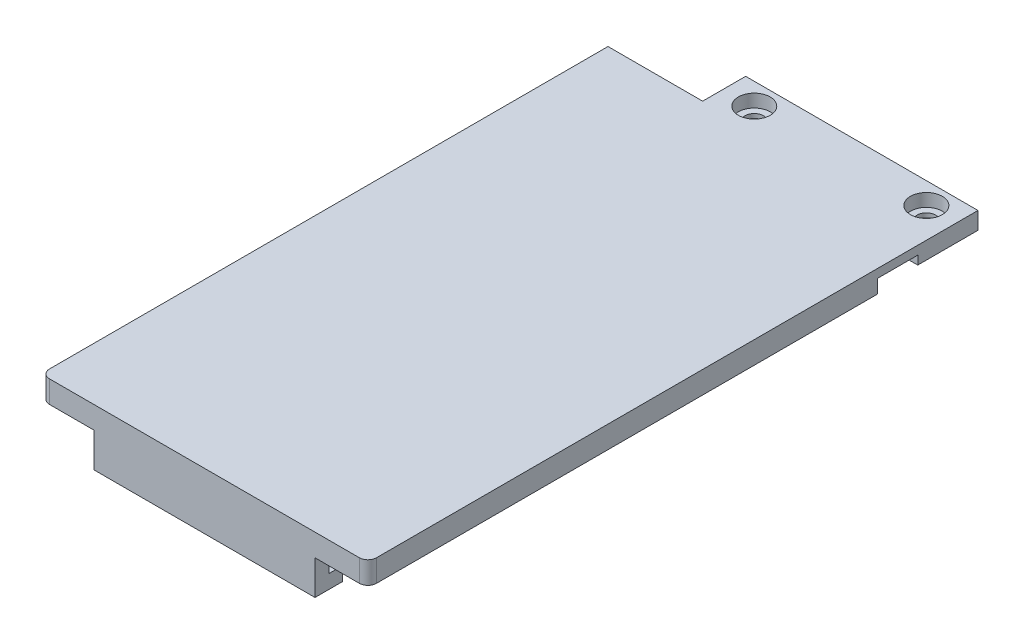
ISO-10303-21;
HEADER;
FILE_DESCRIPTION(('STEP AP214'),'2;1');
FILE_NAME('part.step','',(''),(''),'','','');
FILE_SCHEMA(('AUTOMOTIVE_DESIGN { 1 0 10303 214 1 1 1 1 }'));
ENDSEC;
DATA;
#1=APPLICATION_CONTEXT('core data for automotive mechanical design processes');
#2=APPLICATION_PROTOCOL_DEFINITION('international standard','automotive_design',2000,#1);
#3=PRODUCT_CONTEXT('',#1,'mechanical');
#4=PRODUCT('Part','Part','',(#3));
#5=PRODUCT_RELATED_PRODUCT_CATEGORY('part','',(#4));
#6=PRODUCT_DEFINITION_FORMATION('','',#4);
#7=PRODUCT_DEFINITION_CONTEXT('part definition',#1,'design');
#8=PRODUCT_DEFINITION('design','',#6,#7);
#9=PRODUCT_DEFINITION_SHAPE('','',#8);
#10=(LENGTH_UNIT() NAMED_UNIT(*) SI_UNIT(.MILLI.,.METRE.));
#11=(NAMED_UNIT(*) PLANE_ANGLE_UNIT() SI_UNIT($,.RADIAN.));
#12=(NAMED_UNIT(*) SI_UNIT($,.STERADIAN.) SOLID_ANGLE_UNIT());
#13=UNCERTAINTY_MEASURE_WITH_UNIT(LENGTH_MEASURE(1.E-05),#10,'distance_accuracy_value','');
#14=(GEOMETRIC_REPRESENTATION_CONTEXT(3) GLOBAL_UNCERTAINTY_ASSIGNED_CONTEXT((#13)) GLOBAL_UNIT_ASSIGNED_CONTEXT((#10,
#11,#12)) REPRESENTATION_CONTEXT('',''));
#15=CARTESIAN_POINT('',(0.,0.,0.));
#16=DIRECTION('',(0.,0.,1.));
#17=DIRECTION('',(1.,0.,0.));
#18=AXIS2_PLACEMENT_3D('',#15,#16,#17);
#19=CARTESIAN_POINT('',(15.5,-5.58,-35.45));
#20=DIRECTION('',(0.,1.,0.));
#21=DIRECTION('',(0.,0.,1.));
#22=AXIS2_PLACEMENT_3D('',#19,#20,#21);
#23=CYLINDRICAL_SURFACE('',#22,1.075);
#24=CARTESIAN_POINT('',(15.5,-1.,-35.45));
#25=DIRECTION('',(0.,1.,0.));
#26=DIRECTION('',(0.,0.,1.));
#27=AXIS2_PLACEMENT_3D('',#24,#25,#26);
#28=CIRCLE('',#27,1.075);
#29=CARTESIAN_POINT('',(15.5,-1.,-34.375));
#30=VERTEX_POINT('',#29);
#31=EDGE_CURVE('E259',#30,#30,#28,.T.);
#32=ORIENTED_EDGE('',*,*,#31,.F.);
#33=EDGE_LOOP('',(#32));
#34=FACE_BOUND('',#33,.T.);
#35=CARTESIAN_POINT('',(15.5,-0.5,-35.45));
#36=DIRECTION('',(0.,1.,0.));
#37=DIRECTION('',(0.,0.,1.));
#38=AXIS2_PLACEMENT_3D('',#35,#36,#37);
#39=CIRCLE('',#38,1.075);
#40=CARTESIAN_POINT('',(15.5,-0.5,-34.375));
#41=VERTEX_POINT('',#40);
#42=EDGE_CURVE('E39',#41,#41,#39,.F.);
#43=ORIENTED_EDGE('',*,*,#42,.F.);
#44=EDGE_LOOP('',(#43));
#45=FACE_BOUND('',#44,.T.);
#46=ADVANCED_FACE('F35',(#34,#45),#23,.F.);
#47=CARTESIAN_POINT('',(-4.5,-5.58,-35.45));
#48=DIRECTION('',(0.,1.,0.));
#49=DIRECTION('',(0.,0.,1.));
#50=AXIS2_PLACEMENT_3D('',#47,#48,#49);
#51=CYLINDRICAL_SURFACE('',#50,1.075);
#52=CARTESIAN_POINT('',(-4.5,-1.,-35.45));
#53=DIRECTION('',(0.,1.,0.));
#54=DIRECTION('',(0.,0.,1.));
#55=AXIS2_PLACEMENT_3D('',#52,#53,#54);
#56=CIRCLE('',#55,1.075);
#57=CARTESIAN_POINT('',(-4.5,-1.,-34.375));
#58=VERTEX_POINT('',#57);
#59=EDGE_CURVE('E262',#58,#58,#56,.T.);
#60=ORIENTED_EDGE('',*,*,#59,.F.);
#61=EDGE_LOOP('',(#60));
#62=FACE_BOUND('',#61,.T.);
#63=CARTESIAN_POINT('',(-4.5,-0.5,-35.45));
#64=DIRECTION('',(0.,1.,0.));
#65=DIRECTION('',(0.,0.,1.));
#66=AXIS2_PLACEMENT_3D('',#63,#64,#65);
#67=CIRCLE('',#66,1.075);
#68=CARTESIAN_POINT('',(-4.5,-0.5,-34.375));
#69=VERTEX_POINT('',#68);
#70=EDGE_CURVE('E264',#69,#69,#67,.F.);
#71=ORIENTED_EDGE('',*,*,#70,.F.);
#72=EDGE_LOOP('',(#71));
#73=FACE_BOUND('',#72,.T.);
#74=ADVANCED_FACE('F498',(#62,#73),#51,.F.);
#75=CARTESIAN_POINT('',(-19.,1.,-32.95));
#76=DIRECTION('',(0.,0.,1.));
#77=DIRECTION('',(1.,0.,0.));
#78=AXIS2_PLACEMENT_3D('',#75,#76,#77);
#79=PLANE('',#78);
#80=DIRECTION('',(0.,1.,0.));
#81=VECTOR('',#80,1.);
#82=CARTESIAN_POINT('',(-8.,1.,-32.95));
#83=LINE('',#82,#81);
#84=CARTESIAN_POINT('',(-8.,0.,-32.95));
#85=VERTEX_POINT('',#84);
#86=CARTESIAN_POINT('',(-8.,1.,-32.95));
#87=VERTEX_POINT('',#86);
#88=EDGE_CURVE('E196',#85,#87,#83,.T.);
#89=ORIENTED_EDGE('',*,*,#88,.F.);
#90=DIRECTION('',(-1.,0.,0.));
#91=VECTOR('',#90,1.);
#92=CARTESIAN_POINT('',(-19.,0.,-32.95));
#93=LINE('',#92,#91);
#94=CARTESIAN_POINT('',(-19.,0.,-32.95));
#95=VERTEX_POINT('',#94);
#96=EDGE_CURVE('E235',#85,#95,#93,.T.);
#97=ORIENTED_EDGE('',*,*,#96,.T.);
#98=DIRECTION('',(0.,-1.,0.));
#99=VECTOR('',#98,1.);
#100=CARTESIAN_POINT('',(-19.,1.,-32.95));
#101=LINE('',#100,#99);
#102=CARTESIAN_POINT('',(-19.,1.,-32.95));
#103=VERTEX_POINT('',#102);
#104=EDGE_CURVE('E220',#103,#95,#101,.T.);
#105=ORIENTED_EDGE('',*,*,#104,.F.);
#106=DIRECTION('',(-1.,0.,0.));
#107=VECTOR('',#106,1.);
#108=CARTESIAN_POINT('',(-19.,1.,-32.95));
#109=LINE('',#108,#107);
#110=EDGE_CURVE('E212',#87,#103,#109,.T.);
#111=ORIENTED_EDGE('',*,*,#110,.F.);
#112=EDGE_LOOP('',(#89,#97,#105,#111));
#113=FACE_BOUND('',#112,.T.);
#114=ADVANCED_FACE('F218',(#113),#79,.F.);
#115=CARTESIAN_POINT('',(-3.,24.0867927612304,-30.95));
#116=DIRECTION('',(-1.,0.,0.));
#117=DIRECTION('',(0.,0.,1.));
#118=AXIS2_PLACEMENT_3D('',#115,#116,#117);
#119=PLANE('',#118);
#120=DIRECTION('',(0.,0.,-1.));
#121=VECTOR('',#120,1.);
#122=CARTESIAN_POINT('',(-3.00000000000001,0.,0.));
#123=LINE('',#122,#121);
#124=CARTESIAN_POINT('',(-3.,0.,-30.95));
#125=VERTEX_POINT('',#124);
#126=CARTESIAN_POINT('',(-3.,0.,-32.95));
#127=VERTEX_POINT('',#126);
#128=EDGE_CURVE('E11',#125,#127,#123,.T.);
#129=ORIENTED_EDGE('',*,*,#128,.T.);
#130=DIRECTION('',(0.,1.,0.));
#131=VECTOR('',#130,1.);
#132=CARTESIAN_POINT('',(-3.,1.,-32.95));
#133=LINE('',#132,#131);
#134=CARTESIAN_POINT('',(-3.,-1.,-32.95));
#135=VERTEX_POINT('',#134);
#136=EDGE_CURVE('E207',#135,#127,#133,.T.);
#137=ORIENTED_EDGE('',*,*,#136,.F.);
#138=DIRECTION('',(0.,0.,-1.));
#139=VECTOR('',#138,1.);
#140=CARTESIAN_POINT('',(-3.,-1.,-30.95));
#141=LINE('',#140,#139);
#142=CARTESIAN_POINT('',(-3.,-1.,-30.95));
#143=VERTEX_POINT('',#142);
#144=EDGE_CURVE('E296',#143,#135,#141,.T.);
#145=ORIENTED_EDGE('',*,*,#144,.F.);
#146=DIRECTION('',(0.,-1.,0.));
#147=VECTOR('',#146,1.);
#148=CARTESIAN_POINT('',(-3.,24.0867927612304,-30.95));
#149=LINE('',#148,#147);
#150=EDGE_CURVE('E307',#125,#143,#149,.T.);
#151=ORIENTED_EDGE('',*,*,#150,.F.);
#152=EDGE_LOOP('',(#129,#137,#145,#151));
#153=FACE_BOUND('',#152,.T.);
#154=ADVANCED_FACE('F458',(#153),#119,.T.);
#155=CARTESIAN_POINT('',(-17.4,-1.58,31.35));
#156=DIRECTION('',(0.,0.,1.));
#157=DIRECTION('',(1.,0.,0.));
#158=AXIS2_PLACEMENT_3D('',#155,#156,#157);
#159=PLANE('',#158);
#160=DIRECTION('',(1.,0.,0.));
#161=VECTOR('',#160,1.);
#162=CARTESIAN_POINT('',(12.85,-3.98,31.35));
#163=LINE('',#162,#161);
#164=CARTESIAN_POINT('',(-12.85,-3.98,31.35));
#165=VERTEX_POINT('',#164);
#166=CARTESIAN_POINT('',(12.85,-3.98,31.35));
#167=VERTEX_POINT('',#166);
#168=EDGE_CURVE('E304',#165,#167,#163,.T.);
#169=ORIENTED_EDGE('',*,*,#168,.F.);
#170=DIRECTION('',(0.,1.,0.));
#171=VECTOR('',#170,1.);
#172=CARTESIAN_POINT('',(-12.85,-5.58,31.35));
#173=LINE('',#172,#171);
#174=CARTESIAN_POINT('',(-12.85,-1.58,31.35));
#175=VERTEX_POINT('',#174);
#176=EDGE_CURVE('E346',#165,#175,#173,.T.);
#177=ORIENTED_EDGE('',*,*,#176,.T.);
#178=DIRECTION('',(1.,0.,0.));
#179=VECTOR('',#178,1.);
#180=CARTESIAN_POINT('',(-17.4,-1.58,31.35));
#181=LINE('',#180,#179);
#182=CARTESIAN_POINT('',(-17.4,-1.58,31.35));
#183=VERTEX_POINT('',#182);
#184=EDGE_CURVE('E359',#183,#175,#181,.T.);
#185=ORIENTED_EDGE('',*,*,#184,.F.);
#186=DIRECTION('',(0.,1.,0.));
#187=VECTOR('',#186,1.);
#188=CARTESIAN_POINT('',(-17.4,-1.58,31.35));
#189=LINE('',#188,#187);
#190=CARTESIAN_POINT('',(-17.4,0.,31.35));
#191=VERTEX_POINT('',#190);
#192=EDGE_CURVE('E392',#183,#191,#189,.T.);
#193=ORIENTED_EDGE('',*,*,#192,.T.);
#194=DIRECTION('',(1.,0.,0.));
#195=VECTOR('',#194,1.);
#196=CARTESIAN_POINT('',(-17.4,0.,31.35));
#197=LINE('',#196,#195);
#198=CARTESIAN_POINT('',(17.4,0.,31.35));
#199=VERTEX_POINT('',#198);
#200=EDGE_CURVE('E375',#191,#199,#197,.T.);
#201=ORIENTED_EDGE('',*,*,#200,.T.);
#202=DIRECTION('',(0.,1.,0.));
#203=VECTOR('',#202,1.);
#204=CARTESIAN_POINT('',(17.4,-1.58,31.35));
#205=LINE('',#204,#203);
#206=CARTESIAN_POINT('',(17.4,-1.58,31.35));
#207=VERTEX_POINT('',#206);
#208=EDGE_CURVE('E389',#207,#199,#205,.T.);
#209=ORIENTED_EDGE('',*,*,#208,.F.);
#210=CARTESIAN_POINT('',(12.85,-1.58,31.35));
#211=VERTEX_POINT('',#210);
#212=EDGE_CURVE('E358',#211,#207,#181,.T.);
#213=ORIENTED_EDGE('',*,*,#212,.F.);
#214=DIRECTION('',(0.,1.,0.));
#215=VECTOR('',#214,1.);
#216=CARTESIAN_POINT('',(12.85,-5.58,31.35));
#217=LINE('',#216,#215);
#218=EDGE_CURVE('E344',#167,#211,#217,.T.);
#219=ORIENTED_EDGE('',*,*,#218,.F.);
#220=EDGE_LOOP('',(#169,#177,#185,#193,#201,#209,#213,#219));
#221=FACE_BOUND('',#220,.T.);
#222=ADVANCED_FACE('F417',(#221),#159,.F.);
#223=CARTESIAN_POINT('',(0.,-1.58,0.));
#224=DIRECTION('',(0.,-1.,0.));
#225=DIRECTION('',(0.,0.,-1.));
#226=AXIS2_PLACEMENT_3D('',#223,#224,#225);
#227=PLANE('',#226);
#228=DIRECTION('',(-1.,0.,0.));
#229=VECTOR('',#228,1.);
#230=CARTESIAN_POINT('',(19.,-1.58,32.95));
#231=LINE('',#230,#229);
#232=CARTESIAN_POINT('',(-12.85,-1.58,32.95));
#233=VERTEX_POINT('',#232);
#234=CARTESIAN_POINT('',(-18.,-1.58,32.95));
#235=VERTEX_POINT('',#234);
#236=EDGE_CURVE('E352',#233,#235,#231,.T.);
#237=ORIENTED_EDGE('',*,*,#236,.T.);
#238=CARTESIAN_POINT('',(-18.,-1.58,31.95));
#239=DIRECTION('',(0.,-1.,0.));
#240=DIRECTION('',(0.,0.,-1.));
#241=AXIS2_PLACEMENT_3D('',#238,#239,#240);
#242=CIRCLE('',#241,1.);
#243=CARTESIAN_POINT('',(-19.,-1.58,31.95));
#244=VERTEX_POINT('',#243);
#245=EDGE_CURVE('E247',#235,#244,#242,.T.);
#246=ORIENTED_EDGE('',*,*,#245,.T.);
#247=DIRECTION('',(0.,0.,-1.));
#248=VECTOR('',#247,1.);
#249=CARTESIAN_POINT('',(-19.,-1.58,32.95));
#250=LINE('',#249,#248);
#251=CARTESIAN_POINT('',(-19.,-1.58,-26.25));
#252=VERTEX_POINT('',#251);
#253=EDGE_CURVE('E351',#244,#252,#250,.T.);
#254=ORIENTED_EDGE('',*,*,#253,.T.);
#255=DIRECTION('',(1.,0.,0.));
#256=VECTOR('',#255,1.);
#257=CARTESIAN_POINT('',(-19.,-1.58,-26.25));
#258=LINE('',#257,#256);
#259=CARTESIAN_POINT('',(-17.4,-1.58,-26.25));
#260=VERTEX_POINT('',#259);
#261=EDGE_CURVE('E354',#252,#260,#258,.T.);
#262=ORIENTED_EDGE('',*,*,#261,.T.);
#263=DIRECTION('',(0.,0.,1.));
#264=VECTOR('',#263,1.);
#265=CARTESIAN_POINT('',(-17.4,-1.58,-26.25));
#266=LINE('',#265,#264);
#267=EDGE_CURVE('E356',#260,#183,#266,.T.);
#268=ORIENTED_EDGE('',*,*,#267,.T.);
#269=ORIENTED_EDGE('',*,*,#184,.T.);
#270=DIRECTION('',(0.,0.,-1.));
#271=VECTOR('',#270,1.);
#272=CARTESIAN_POINT('',(-12.85,-1.58,32.95));
#273=LINE('',#272,#271);
#274=EDGE_CURVE('E326',#233,#175,#273,.T.);
#275=ORIENTED_EDGE('',*,*,#274,.F.);
#276=EDGE_LOOP('',(#237,#246,#254,#262,#268,#269,#275));
#277=FACE_BOUND('',#276,.T.);
#278=ADVANCED_FACE('F422',(#277),#227,.T.);
#279=CARTESIAN_POINT('',(19.,1.,32.95));
#280=DIRECTION('',(-1.,0.,0.));
#281=DIRECTION('',(0.,0.,1.));
#282=AXIS2_PLACEMENT_3D('',#279,#280,#281);
#283=PLANE('',#282);
#284=DIRECTION('',(0.,0.,-1.));
#285=VECTOR('',#284,1.);
#286=CARTESIAN_POINT('',(19.,0.,32.95));
#287=LINE('',#286,#285);
#288=CARTESIAN_POINT('',(19.,0.,-26.25));
#289=VERTEX_POINT('',#288);
#290=CARTESIAN_POINT('',(19.,0.,-30.95));
#291=VERTEX_POINT('',#290);
#292=EDGE_CURVE('E233',#289,#291,#287,.T.);
#293=ORIENTED_EDGE('',*,*,#292,.T.);
#294=DIRECTION('',(0.,-1.,0.));
#295=VECTOR('',#294,1.);
#296=CARTESIAN_POINT('',(19.,24.0867927612304,-30.95));
#297=LINE('',#296,#295);
#298=CARTESIAN_POINT('',(19.,-1.,-30.95));
#299=VERTEX_POINT('',#298);
#300=EDGE_CURVE('E302',#291,#299,#297,.T.);
#301=ORIENTED_EDGE('',*,*,#300,.T.);
#302=DIRECTION('',(0.,0.,1.));
#303=VECTOR('',#302,1.);
#304=CARTESIAN_POINT('',(19.,-1.,-30.95));
#305=LINE('',#304,#303);
#306=CARTESIAN_POINT('',(19.,-1.,-37.95));
#307=VERTEX_POINT('',#306);
#308=EDGE_CURVE('E290',#307,#299,#305,.T.);
#309=ORIENTED_EDGE('',*,*,#308,.F.);
#310=DIRECTION('',(0.,-1.,0.));
#311=VECTOR('',#310,1.);
#312=CARTESIAN_POINT('',(19.,24.0867927612304,-37.95));
#313=LINE('',#312,#311);
#314=CARTESIAN_POINT('',(19.,1.,-37.95));
#315=VERTEX_POINT('',#314);
#316=EDGE_CURVE('E305',#315,#307,#313,.T.);
#317=ORIENTED_EDGE('',*,*,#316,.F.);
#318=DIRECTION('',(0.,0.,-1.));
#319=VECTOR('',#318,1.);
#320=CARTESIAN_POINT('',(19.,1.,32.95));
#321=LINE('',#320,#319);
#322=CARTESIAN_POINT('',(19.,1.,31.95));
#323=VERTEX_POINT('',#322);
#324=EDGE_CURVE('E223',#323,#315,#321,.T.);
#325=ORIENTED_EDGE('',*,*,#324,.F.);
#326=DIRECTION('',(0.,-1.,0.));
#327=VECTOR('',#326,1.);
#328=CARTESIAN_POINT('',(19.,1.,31.95));
#329=LINE('',#328,#327);
#330=CARTESIAN_POINT('',(19.,-1.58,31.95));
#331=VERTEX_POINT('',#330);
#332=EDGE_CURVE('E255',#323,#331,#329,.T.);
#333=ORIENTED_EDGE('',*,*,#332,.T.);
#334=DIRECTION('',(0.,0.,1.));
#335=VECTOR('',#334,1.);
#336=CARTESIAN_POINT('',(19.,-1.58,-26.25));
#337=LINE('',#336,#335);
#338=CARTESIAN_POINT('',(19.,-1.58,-26.25));
#339=VERTEX_POINT('',#338);
#340=EDGE_CURVE('E366',#339,#331,#337,.T.);
#341=ORIENTED_EDGE('',*,*,#340,.F.);
#342=DIRECTION('',(0.,1.,0.));
#343=VECTOR('',#342,1.);
#344=CARTESIAN_POINT('',(19.,-1.58,-26.25));
#345=LINE('',#344,#343);
#346=EDGE_CURVE('E369',#339,#289,#345,.T.);
#347=ORIENTED_EDGE('',*,*,#346,.T.);
#348=EDGE_LOOP('',(#293,#301,#309,#317,#325,#333,#341,#347));
#349=FACE_BOUND('',#348,.T.);
#350=ADVANCED_FACE('F443',(#349),#283,.F.);
#351=CARTESIAN_POINT('',(-19.,1.,32.95));
#352=DIRECTION('',(1.,0.,0.));
#353=DIRECTION('',(0.,0.,-1.));
#354=AXIS2_PLACEMENT_3D('',#351,#352,#353);
#355=PLANE('',#354);
#356=ORIENTED_EDGE('',*,*,#253,.F.);
#357=DIRECTION('',(0.,-1.,0.));
#358=VECTOR('',#357,1.);
#359=CARTESIAN_POINT('',(-19.,1.,31.95));
#360=LINE('',#359,#358);
#361=CARTESIAN_POINT('',(-19.,1.,31.95));
#362=VERTEX_POINT('',#361);
#363=EDGE_CURVE('E249',#244,#362,#360,.F.);
#364=ORIENTED_EDGE('',*,*,#363,.T.);
#365=DIRECTION('',(0.,0.,1.));
#366=VECTOR('',#365,1.);
#367=CARTESIAN_POINT('',(-19.,1.,32.95));
#368=LINE('',#367,#366);
#369=EDGE_CURVE('E222',#103,#362,#368,.T.);
#370=ORIENTED_EDGE('',*,*,#369,.F.);
#371=ORIENTED_EDGE('',*,*,#104,.T.);
#372=DIRECTION('',(0.,0.,1.));
#373=VECTOR('',#372,1.);
#374=CARTESIAN_POINT('',(-19.,0.,32.95));
#375=LINE('',#374,#373);
#376=CARTESIAN_POINT('',(-19.,0.,-26.25));
#377=VERTEX_POINT('',#376);
#378=EDGE_CURVE('E227',#95,#377,#375,.T.);
#379=ORIENTED_EDGE('',*,*,#378,.T.);
#380=DIRECTION('',(0.,1.,0.));
#381=VECTOR('',#380,1.);
#382=CARTESIAN_POINT('',(-19.,-1.58,-26.25));
#383=LINE('',#382,#381);
#384=EDGE_CURVE('E236',#252,#377,#383,.T.);
#385=ORIENTED_EDGE('',*,*,#384,.F.);
#386=EDGE_LOOP('',(#356,#364,#370,#371,#379,#385));
#387=FACE_BOUND('',#386,.T.);
#388=ADVANCED_FACE('F405',(#387),#355,.F.);
#389=CARTESIAN_POINT('',(-19.,1.,32.95));
#390=DIRECTION('',(0.,0.,-1.));
#391=DIRECTION('',(-1.,0.,0.));
#392=AXIS2_PLACEMENT_3D('',#389,#390,#391);
#393=PLANE('',#392);
#394=DIRECTION('',(1.,0.,0.));
#395=VECTOR('',#394,1.);
#396=CARTESIAN_POINT('',(-19.,1.,32.95));
#397=LINE('',#396,#395);
#398=CARTESIAN_POINT('',(-18.,1.,32.95));
#399=VERTEX_POINT('',#398);
#400=CARTESIAN_POINT('',(18.,1.,32.95));
#401=VERTEX_POINT('',#400);
#402=EDGE_CURVE('E225',#399,#401,#397,.T.);
#403=ORIENTED_EDGE('',*,*,#402,.F.);
#404=DIRECTION('',(0.,-1.,0.));
#405=VECTOR('',#404,1.);
#406=CARTESIAN_POINT('',(-18.,1.,32.95));
#407=LINE('',#406,#405);
#408=EDGE_CURVE('E244',#399,#235,#407,.T.);
#409=ORIENTED_EDGE('',*,*,#408,.T.);
#410=ORIENTED_EDGE('',*,*,#236,.F.);
#411=DIRECTION('',(0.,1.,0.));
#412=VECTOR('',#411,1.);
#413=CARTESIAN_POINT('',(-12.85,-5.58,32.95));
#414=LINE('',#413,#412);
#415=CARTESIAN_POINT('',(-12.85,-5.58,32.95));
#416=VERTEX_POINT('',#415);
#417=EDGE_CURVE('E334',#416,#233,#414,.T.);
#418=ORIENTED_EDGE('',*,*,#417,.F.);
#419=DIRECTION('',(-1.,0.,0.));
#420=VECTOR('',#419,1.);
#421=CARTESIAN_POINT('',(-12.85,-5.58,32.95));
#422=LINE('',#421,#420);
#423=CARTESIAN_POINT('',(12.85,-5.58,32.95));
#424=VERTEX_POINT('',#423);
#425=EDGE_CURVE('E332',#424,#416,#422,.T.);
#426=ORIENTED_EDGE('',*,*,#425,.F.);
#427=DIRECTION('',(0.,1.,0.));
#428=VECTOR('',#427,1.);
#429=CARTESIAN_POINT('',(12.85,-5.58,32.95));
#430=LINE('',#429,#428);
#431=CARTESIAN_POINT('',(12.85,-1.58,32.95));
#432=VERTEX_POINT('',#431);
#433=EDGE_CURVE('E341',#424,#432,#430,.T.);
#434=ORIENTED_EDGE('',*,*,#433,.T.);
#435=CARTESIAN_POINT('',(18.,-1.58,32.95));
#436=VERTEX_POINT('',#435);
#437=EDGE_CURVE('E349',#436,#432,#231,.T.);
#438=ORIENTED_EDGE('',*,*,#437,.F.);
#439=DIRECTION('',(0.,-1.,0.));
#440=VECTOR('',#439,1.);
#441=CARTESIAN_POINT('',(18.,1.,32.95));
#442=LINE('',#441,#440);
#443=EDGE_CURVE('E242',#436,#401,#442,.F.);
#444=ORIENTED_EDGE('',*,*,#443,.T.);
#445=EDGE_LOOP('',(#403,#409,#410,#418,#426,#434,#438,#444));
#446=FACE_BOUND('',#445,.T.);
#447=ADVANCED_FACE('F433',(#446),#393,.F.);
#448=CARTESIAN_POINT('',(0.,1.,0.));
#449=DIRECTION('',(0.,-1.,0.));
#450=DIRECTION('',(0.,0.,-1.));
#451=AXIS2_PLACEMENT_3D('',#448,#449,#450);
#452=PLANE('',#451);
#453=CARTESIAN_POINT('',(-4.5,1.,-35.45));
#454=DIRECTION('',(0.,1.,0.));
#455=DIRECTION('',(0.,0.,1.));
#456=AXIS2_PLACEMENT_3D('',#453,#454,#455);
#457=CIRCLE('',#456,1.85);
#458=CARTESIAN_POINT('',(-4.5,1.,-33.6));
#459=VERTEX_POINT('',#458);
#460=EDGE_CURVE('E271',#459,#459,#457,.T.);
#461=ORIENTED_EDGE('',*,*,#460,.F.);
#462=EDGE_LOOP('',(#461));
#463=FACE_BOUND('',#462,.T.);
#464=CARTESIAN_POINT('',(15.5,1.,-35.45));
#465=DIRECTION('',(0.,1.,0.));
#466=DIRECTION('',(0.,0.,1.));
#467=AXIS2_PLACEMENT_3D('',#464,#465,#466);
#468=CIRCLE('',#467,1.85);
#469=CARTESIAN_POINT('',(15.5,1.,-33.6));
#470=VERTEX_POINT('',#469);
#471=EDGE_CURVE('E281',#470,#470,#468,.T.);
#472=ORIENTED_EDGE('',*,*,#471,.F.);
#473=EDGE_LOOP('',(#472));
#474=FACE_BOUND('',#473,.T.);
#475=DIRECTION('',(0.,0.,-1.));
#476=VECTOR('',#475,1.);
#477=CARTESIAN_POINT('',(-8.,1.,-32.95));
#478=LINE('',#477,#476);
#479=CARTESIAN_POINT('',(-7.99999999999999,1.,-37.95));
#480=VERTEX_POINT('',#479);
#481=EDGE_CURVE('E200',#87,#480,#478,.T.);
#482=ORIENTED_EDGE('',*,*,#481,.F.);
#483=ORIENTED_EDGE('',*,*,#110,.T.);
#484=ORIENTED_EDGE('',*,*,#369,.T.);
#485=CARTESIAN_POINT('',(-18.,1.,31.95));
#486=DIRECTION('',(0.,-1.,0.));
#487=DIRECTION('',(0.,0.,-1.));
#488=AXIS2_PLACEMENT_3D('',#485,#486,#487);
#489=CIRCLE('',#488,1.);
#490=EDGE_CURVE('E253',#362,#399,#489,.F.);
#491=ORIENTED_EDGE('',*,*,#490,.T.);
#492=ORIENTED_EDGE('',*,*,#402,.T.);
#493=CARTESIAN_POINT('',(18.,1.,31.95));
#494=DIRECTION('',(0.,-1.,0.));
#495=DIRECTION('',(0.,0.,-1.));
#496=AXIS2_PLACEMENT_3D('',#493,#494,#495);
#497=CIRCLE('',#496,1.);
#498=EDGE_CURVE('E251',#401,#323,#497,.F.);
#499=ORIENTED_EDGE('',*,*,#498,.T.);
#500=ORIENTED_EDGE('',*,*,#324,.T.);
#501=DIRECTION('',(-1.,0.,0.));
#502=VECTOR('',#501,1.);
#503=CARTESIAN_POINT('',(19.,1.,-37.95));
#504=LINE('',#503,#502);
#505=EDGE_CURVE('E215',#315,#480,#504,.T.);
#506=ORIENTED_EDGE('',*,*,#505,.T.);
#507=EDGE_LOOP('',(#482,#483,#484,#491,#492,#499,#500,#506));
#508=FACE_BOUND('',#507,.T.);
#509=ADVANCED_FACE('F210',(#463,#474,#508),#452,.F.);
#510=CARTESIAN_POINT('',(0.,0.,0.));
#511=DIRECTION('',(0.,-1.,0.));
#512=DIRECTION('',(0.,0.,-1.));
#513=AXIS2_PLACEMENT_3D('',#510,#511,#512);
#514=PLANE('',#513);
#515=ORIENTED_EDGE('',*,*,#128,.F.);
#516=DIRECTION('',(-1.,0.,0.));
#517=VECTOR('',#516,1.);
#518=CARTESIAN_POINT('',(0.,0.,-30.95));
#519=LINE('',#518,#517);
#520=EDGE_CURVE('E44',#291,#125,#519,.T.);
#521=ORIENTED_EDGE('',*,*,#520,.F.);
#522=ORIENTED_EDGE('',*,*,#292,.F.);
#523=DIRECTION('',(1.,0.,0.));
#524=VECTOR('',#523,1.);
#525=CARTESIAN_POINT('',(17.4,0.,-26.25));
#526=LINE('',#525,#524);
#527=CARTESIAN_POINT('',(17.4,0.,-26.25));
#528=VERTEX_POINT('',#527);
#529=EDGE_CURVE('E381',#528,#289,#526,.T.);
#530=ORIENTED_EDGE('',*,*,#529,.F.);
#531=DIRECTION('',(0.,0.,-1.));
#532=VECTOR('',#531,1.);
#533=CARTESIAN_POINT('',(17.4,0.,31.35));
#534=LINE('',#533,#532);
#535=EDGE_CURVE('E378',#199,#528,#534,.T.);
#536=ORIENTED_EDGE('',*,*,#535,.F.);
#537=ORIENTED_EDGE('',*,*,#200,.F.);
#538=DIRECTION('',(0.,0.,1.));
#539=VECTOR('',#538,1.);
#540=CARTESIAN_POINT('',(-17.4,0.,-26.25));
#541=LINE('',#540,#539);
#542=CARTESIAN_POINT('',(-17.4,0.,-26.25));
#543=VERTEX_POINT('',#542);
#544=EDGE_CURVE('E372',#543,#191,#541,.T.);
#545=ORIENTED_EDGE('',*,*,#544,.F.);
#546=DIRECTION('',(1.,0.,0.));
#547=VECTOR('',#546,1.);
#548=CARTESIAN_POINT('',(-19.,0.,-26.25));
#549=LINE('',#548,#547);
#550=EDGE_CURVE('E348',#377,#543,#549,.T.);
#551=ORIENTED_EDGE('',*,*,#550,.F.);
#552=ORIENTED_EDGE('',*,*,#378,.F.);
#553=ORIENTED_EDGE('',*,*,#96,.F.);
#554=EDGE_CURVE('E237',#127,#85,#93,.T.);
#555=ORIENTED_EDGE('',*,*,#554,.F.);
#556=EDGE_LOOP('',(#515,#521,#522,#530,#536,#537,#545,#551,#552,#553,#555));
#557=FACE_BOUND('',#556,.T.);
#558=ADVANCED_FACE('F408',(#557),#514,.T.);
#559=CARTESIAN_POINT('',(-19.,-1.58,-26.25));
#560=DIRECTION('',(0.,0.,1.));
#561=DIRECTION('',(1.,0.,0.));
#562=AXIS2_PLACEMENT_3D('',#559,#560,#561);
#563=PLANE('',#562);
#564=ORIENTED_EDGE('',*,*,#550,.T.);
#565=DIRECTION('',(0.,1.,0.));
#566=VECTOR('',#565,1.);
#567=CARTESIAN_POINT('',(-17.4,-1.58,-26.25));
#568=LINE('',#567,#566);
#569=EDGE_CURVE('E395',#260,#543,#568,.T.);
#570=ORIENTED_EDGE('',*,*,#569,.F.);
#571=ORIENTED_EDGE('',*,*,#261,.F.);
#572=ORIENTED_EDGE('',*,*,#384,.T.);
#573=EDGE_LOOP('',(#564,#570,#571,#572));
#574=FACE_BOUND('',#573,.T.);
#575=ADVANCED_FACE('F401',(#574),#563,.F.);
#576=CARTESIAN_POINT('',(-17.4,-1.58,-26.25));
#577=DIRECTION('',(-1.,0.,0.));
#578=DIRECTION('',(0.,0.,1.));
#579=AXIS2_PLACEMENT_3D('',#576,#577,#578);
#580=PLANE('',#579);
#581=ORIENTED_EDGE('',*,*,#544,.T.);
#582=ORIENTED_EDGE('',*,*,#192,.F.);
#583=ORIENTED_EDGE('',*,*,#267,.F.);
#584=ORIENTED_EDGE('',*,*,#569,.T.);
#585=EDGE_LOOP('',(#581,#582,#583,#584));
#586=FACE_BOUND('',#585,.T.);
#587=ADVANCED_FACE('F412',(#586),#580,.F.);
#588=CARTESIAN_POINT('',(17.4,-1.58,31.35));
#589=DIRECTION('',(1.,0.,0.));
#590=DIRECTION('',(0.,0.,-1.));
#591=AXIS2_PLACEMENT_3D('',#588,#589,#590);
#592=PLANE('',#591);
#593=ORIENTED_EDGE('',*,*,#535,.T.);
#594=DIRECTION('',(0.,1.,0.));
#595=VECTOR('',#594,1.);
#596=CARTESIAN_POINT('',(17.4,-1.58,-26.25));
#597=LINE('',#596,#595);
#598=CARTESIAN_POINT('',(17.4,-1.58,-26.25));
#599=VERTEX_POINT('',#598);
#600=EDGE_CURVE('E386',#599,#528,#597,.T.);
#601=ORIENTED_EDGE('',*,*,#600,.F.);
#602=DIRECTION('',(0.,0.,-1.));
#603=VECTOR('',#602,1.);
#604=CARTESIAN_POINT('',(17.4,-1.58,31.35));
#605=LINE('',#604,#603);
#606=EDGE_CURVE('E362',#207,#599,#605,.T.);
#607=ORIENTED_EDGE('',*,*,#606,.F.);
#608=ORIENTED_EDGE('',*,*,#208,.T.);
#609=EDGE_LOOP('',(#593,#601,#607,#608));
#610=FACE_BOUND('',#609,.T.);
#611=ADVANCED_FACE('F470',(#610),#592,.F.);
#612=CARTESIAN_POINT('',(17.4,-1.58,-26.25));
#613=DIRECTION('',(0.,0.,1.));
#614=DIRECTION('',(1.,0.,0.));
#615=AXIS2_PLACEMENT_3D('',#612,#613,#614);
#616=PLANE('',#615);
#617=ORIENTED_EDGE('',*,*,#529,.T.);
#618=ORIENTED_EDGE('',*,*,#346,.F.);
#619=DIRECTION('',(1.,0.,0.));
#620=VECTOR('',#619,1.);
#621=CARTESIAN_POINT('',(17.4,-1.58,-26.25));
#622=LINE('',#621,#620);
#623=EDGE_CURVE('E364',#599,#339,#622,.T.);
#624=ORIENTED_EDGE('',*,*,#623,.F.);
#625=ORIENTED_EDGE('',*,*,#600,.T.);
#626=EDGE_LOOP('',(#617,#618,#624,#625));
#627=FACE_BOUND('',#626,.T.);
#628=ADVANCED_FACE('F465',(#627),#616,.F.);
#629=ORIENTED_EDGE('',*,*,#340,.T.);
#630=CARTESIAN_POINT('',(18.,-1.58,31.95));
#631=DIRECTION('',(0.,-1.,0.));
#632=DIRECTION('',(0.,0.,-1.));
#633=AXIS2_PLACEMENT_3D('',#630,#631,#632);
#634=CIRCLE('',#633,1.);
#635=EDGE_CURVE('E59',#331,#436,#634,.T.);
#636=ORIENTED_EDGE('',*,*,#635,.T.);
#637=ORIENTED_EDGE('',*,*,#437,.T.);
#638=DIRECTION('',(0.,0.,1.));
#639=VECTOR('',#638,1.);
#640=CARTESIAN_POINT('',(12.85,-1.58,32.95));
#641=LINE('',#640,#639);
#642=EDGE_CURVE('E330',#211,#432,#641,.T.);
#643=ORIENTED_EDGE('',*,*,#642,.F.);
#644=ORIENTED_EDGE('',*,*,#212,.T.);
#645=ORIENTED_EDGE('',*,*,#606,.T.);
#646=ORIENTED_EDGE('',*,*,#623,.T.);
#647=EDGE_LOOP('',(#629,#636,#637,#643,#644,#645,#646));
#648=FACE_BOUND('',#647,.T.);
#649=ADVANCED_FACE('F475',(#648),#227,.T.);
#650=CARTESIAN_POINT('',(-12.85,-5.58,32.95));
#651=DIRECTION('',(1.,0.,0.));
#652=DIRECTION('',(0.,0.,-1.));
#653=AXIS2_PLACEMENT_3D('',#650,#651,#652);
#654=PLANE('',#653);
#655=ORIENTED_EDGE('',*,*,#274,.T.);
#656=ORIENTED_EDGE('',*,*,#176,.F.);
#657=DIRECTION('',(0.,0.,1.));
#658=VECTOR('',#657,1.);
#659=CARTESIAN_POINT('',(-12.85,-3.98,29.75));
#660=LINE('',#659,#658);
#661=CARTESIAN_POINT('',(-12.85,-3.98,29.75));
#662=VERTEX_POINT('',#661);
#663=EDGE_CURVE('E324',#662,#165,#660,.T.);
#664=ORIENTED_EDGE('',*,*,#663,.F.);
#665=DIRECTION('',(0.,1.,0.));
#666=VECTOR('',#665,1.);
#667=CARTESIAN_POINT('',(-12.85,-5.58,29.75));
#668=LINE('',#667,#666);
#669=CARTESIAN_POINT('',(-12.85,-5.58,29.75));
#670=VERTEX_POINT('',#669);
#671=EDGE_CURVE('E316',#670,#662,#668,.T.);
#672=ORIENTED_EDGE('',*,*,#671,.F.);
#673=DIRECTION('',(0.,0.,-1.));
#674=VECTOR('',#673,1.);
#675=CARTESIAN_POINT('',(-12.85,-5.58,32.95));
#676=LINE('',#675,#674);
#677=EDGE_CURVE('E327',#416,#670,#676,.T.);
#678=ORIENTED_EDGE('',*,*,#677,.F.);
#679=ORIENTED_EDGE('',*,*,#417,.T.);
#680=EDGE_LOOP('',(#655,#656,#664,#672,#678,#679));
#681=FACE_BOUND('',#680,.T.);
#682=ADVANCED_FACE('F425',(#681),#654,.F.);
#683=CARTESIAN_POINT('',(12.85,-5.58,32.95));
#684=DIRECTION('',(-1.,0.,0.));
#685=DIRECTION('',(0.,0.,1.));
#686=AXIS2_PLACEMENT_3D('',#683,#684,#685);
#687=PLANE('',#686);
#688=ORIENTED_EDGE('',*,*,#642,.T.);
#689=ORIENTED_EDGE('',*,*,#433,.F.);
#690=DIRECTION('',(0.,0.,1.));
#691=VECTOR('',#690,1.);
#692=CARTESIAN_POINT('',(12.85,-5.58,32.95));
#693=LINE('',#692,#691);
#694=CARTESIAN_POINT('',(12.85,-5.58,29.75));
#695=VERTEX_POINT('',#694);
#696=EDGE_CURVE('E329',#695,#424,#693,.T.);
#697=ORIENTED_EDGE('',*,*,#696,.F.);
#698=DIRECTION('',(0.,-1.,0.));
#699=VECTOR('',#698,1.);
#700=CARTESIAN_POINT('',(12.85,-5.58,29.75));
#701=LINE('',#700,#699);
#702=CARTESIAN_POINT('',(12.85,-3.98,29.75));
#703=VERTEX_POINT('',#702);
#704=EDGE_CURVE('E310',#703,#695,#701,.T.);
#705=ORIENTED_EDGE('',*,*,#704,.F.);
#706=DIRECTION('',(0.,0.,1.));
#707=VECTOR('',#706,1.);
#708=CARTESIAN_POINT('',(12.85,-3.98,29.75));
#709=LINE('',#708,#707);
#710=EDGE_CURVE('E320',#703,#167,#709,.T.);
#711=ORIENTED_EDGE('',*,*,#710,.T.);
#712=ORIENTED_EDGE('',*,*,#218,.T.);
#713=EDGE_LOOP('',(#688,#689,#697,#705,#711,#712));
#714=FACE_BOUND('',#713,.T.);
#715=ADVANCED_FACE('F478',(#714),#687,.F.);
#716=CARTESIAN_POINT('',(0.,-5.58,0.));
#717=DIRECTION('',(0.,-1.,0.));
#718=DIRECTION('',(0.,0.,-1.));
#719=AXIS2_PLACEMENT_3D('',#716,#717,#718);
#720=PLANE('',#719);
#721=ORIENTED_EDGE('',*,*,#677,.T.);
#722=DIRECTION('',(-1.,0.,0.));
#723=VECTOR('',#722,1.);
#724=CARTESIAN_POINT('',(12.85,-5.58,29.75));
#725=LINE('',#724,#723);
#726=EDGE_CURVE('E313',#695,#670,#725,.T.);
#727=ORIENTED_EDGE('',*,*,#726,.F.);
#728=ORIENTED_EDGE('',*,*,#696,.T.);
#729=ORIENTED_EDGE('',*,*,#425,.T.);
#730=EDGE_LOOP('',(#721,#727,#728,#729));
#731=FACE_BOUND('',#730,.T.);
#732=ADVANCED_FACE('F488',(#731),#720,.T.);
#733=CARTESIAN_POINT('',(12.85,-3.98,29.75));
#734=DIRECTION('',(0.,-1.,0.));
#735=DIRECTION('',(0.,0.,-1.));
#736=AXIS2_PLACEMENT_3D('',#733,#734,#735);
#737=PLANE('',#736);
#738=ORIENTED_EDGE('',*,*,#168,.T.);
#739=ORIENTED_EDGE('',*,*,#710,.F.);
#740=DIRECTION('',(1.,0.,0.));
#741=VECTOR('',#740,1.);
#742=CARTESIAN_POINT('',(12.85,-3.98,29.75));
#743=LINE('',#742,#741);
#744=EDGE_CURVE('E318',#662,#703,#743,.T.);
#745=ORIENTED_EDGE('',*,*,#744,.F.);
#746=ORIENTED_EDGE('',*,*,#663,.T.);
#747=EDGE_LOOP('',(#738,#739,#745,#746));
#748=FACE_BOUND('',#747,.T.);
#749=ADVANCED_FACE('F483',(#748),#737,.F.);
#750=CARTESIAN_POINT('',(0.,0.,29.75));
#751=DIRECTION('',(0.,0.,1.));
#752=DIRECTION('',(1.,0.,0.));
#753=AXIS2_PLACEMENT_3D('',#750,#751,#752);
#754=PLANE('',#753);
#755=ORIENTED_EDGE('',*,*,#704,.T.);
#756=ORIENTED_EDGE('',*,*,#726,.T.);
#757=ORIENTED_EDGE('',*,*,#671,.T.);
#758=ORIENTED_EDGE('',*,*,#744,.T.);
#759=EDGE_LOOP('',(#755,#756,#757,#758));
#760=FACE_BOUND('',#759,.T.);
#761=ADVANCED_FACE('F485',(#760),#754,.F.);
#762=CARTESIAN_POINT('',(-18.,1.,31.95));
#763=DIRECTION('',(0.,-1.,0.));
#764=DIRECTION('',(0.,0.,-1.));
#765=AXIS2_PLACEMENT_3D('',#762,#763,#764);
#766=CYLINDRICAL_SURFACE('',#765,1.);
#767=ORIENTED_EDGE('',*,*,#490,.F.);
#768=ORIENTED_EDGE('',*,*,#363,.F.);
#769=ORIENTED_EDGE('',*,*,#245,.F.);
#770=ORIENTED_EDGE('',*,*,#408,.F.);
#771=EDGE_LOOP('',(#767,#768,#769,#770));
#772=FACE_BOUND('',#771,.T.);
#773=ADVANCED_FACE('F437',(#772),#766,.T.);
#774=CARTESIAN_POINT('',(18.,1.,31.95));
#775=DIRECTION('',(0.,-1.,0.));
#776=DIRECTION('',(0.,0.,-1.));
#777=AXIS2_PLACEMENT_3D('',#774,#775,#776);
#778=CYLINDRICAL_SURFACE('',#777,1.);
#779=ORIENTED_EDGE('',*,*,#498,.F.);
#780=ORIENTED_EDGE('',*,*,#443,.F.);
#781=ORIENTED_EDGE('',*,*,#635,.F.);
#782=ORIENTED_EDGE('',*,*,#332,.F.);
#783=EDGE_LOOP('',(#779,#780,#781,#782));
#784=FACE_BOUND('',#783,.T.);
#785=ADVANCED_FACE('F37',(#784),#778,.T.);
#786=CARTESIAN_POINT('',(19.,24.0867927612304,-37.95));
#787=DIRECTION('',(0.,0.,-1.));
#788=DIRECTION('',(-1.,0.,0.));
#789=AXIS2_PLACEMENT_3D('',#786,#787,#788);
#790=PLANE('',#789);
#791=ORIENTED_EDGE('',*,*,#505,.F.);
#792=ORIENTED_EDGE('',*,*,#316,.T.);
#793=DIRECTION('',(1.,0.,0.));
#794=VECTOR('',#793,1.);
#795=CARTESIAN_POINT('',(19.,-1.,-37.95));
#796=LINE('',#795,#794);
#797=CARTESIAN_POINT('',(-7.99999999999999,-1.,-37.95));
#798=VERTEX_POINT('',#797);
#799=EDGE_CURVE('E299',#798,#307,#796,.T.);
#800=ORIENTED_EDGE('',*,*,#799,.F.);
#801=DIRECTION('',(0.,-1.,0.));
#802=VECTOR('',#801,1.);
#803=CARTESIAN_POINT('',(-7.99999999999999,1.,-37.95));
#804=LINE('',#803,#802);
#805=EDGE_CURVE('E216',#480,#798,#804,.T.);
#806=ORIENTED_EDGE('',*,*,#805,.F.);
#807=EDGE_LOOP('',(#791,#792,#800,#806));
#808=FACE_BOUND('',#807,.T.);
#809=ADVANCED_FACE('F447',(#808),#790,.T.);
#810=CARTESIAN_POINT('',(19.,24.0867927612304,-30.95));
#811=DIRECTION('',(0.,0.,1.));
#812=DIRECTION('',(1.,0.,0.));
#813=AXIS2_PLACEMENT_3D('',#810,#811,#812);
#814=PLANE('',#813);
#815=ORIENTED_EDGE('',*,*,#300,.F.);
#816=ORIENTED_EDGE('',*,*,#520,.T.);
#817=ORIENTED_EDGE('',*,*,#150,.T.);
#818=DIRECTION('',(-1.,0.,0.));
#819=VECTOR('',#818,1.);
#820=CARTESIAN_POINT('',(19.,-1.,-30.95));
#821=LINE('',#820,#819);
#822=EDGE_CURVE('E293',#299,#143,#821,.T.);
#823=ORIENTED_EDGE('',*,*,#822,.F.);
#824=EDGE_LOOP('',(#815,#816,#817,#823));
#825=FACE_BOUND('',#824,.T.);
#826=ADVANCED_FACE('F462',(#825),#814,.T.);
#827=CARTESIAN_POINT('',(0.,-1.,0.));
#828=DIRECTION('',(0.,1.,0.));
#829=DIRECTION('',(0.,0.,1.));
#830=AXIS2_PLACEMENT_3D('',#827,#828,#829);
#831=PLANE('',#830);
#832=ORIENTED_EDGE('',*,*,#59,.T.);
#833=EDGE_LOOP('',(#832));
#834=FACE_BOUND('',#833,.T.);
#835=ORIENTED_EDGE('',*,*,#31,.T.);
#836=EDGE_LOOP('',(#835));
#837=FACE_BOUND('',#836,.T.);
#838=ORIENTED_EDGE('',*,*,#308,.T.);
#839=ORIENTED_EDGE('',*,*,#822,.T.);
#840=ORIENTED_EDGE('',*,*,#144,.T.);
#841=DIRECTION('',(1.,0.,0.));
#842=VECTOR('',#841,1.);
#843=CARTESIAN_POINT('',(-8.,-1.,-32.95));
#844=LINE('',#843,#842);
#845=CARTESIAN_POINT('',(-8.,-1.,-32.95));
#846=VERTEX_POINT('',#845);
#847=EDGE_CURVE('E287',#846,#135,#844,.T.);
#848=ORIENTED_EDGE('',*,*,#847,.F.);
#849=DIRECTION('',(0.,0.,1.));
#850=VECTOR('',#849,1.);
#851=CARTESIAN_POINT('',(-8.,-1.,-32.95));
#852=LINE('',#851,#850);
#853=EDGE_CURVE('E285',#798,#846,#852,.T.);
#854=ORIENTED_EDGE('',*,*,#853,.F.);
#855=ORIENTED_EDGE('',*,*,#799,.T.);
#856=EDGE_LOOP('',(#838,#839,#840,#848,#854,#855));
#857=FACE_BOUND('',#856,.T.);
#858=ADVANCED_FACE('F450',(#834,#837,#857),#831,.F.);
#859=CARTESIAN_POINT('',(-8.,1.,-32.95));
#860=DIRECTION('',(0.,0.,-1.));
#861=DIRECTION('',(-1.,0.,0.));
#862=AXIS2_PLACEMENT_3D('',#859,#860,#861);
#863=PLANE('',#862);
#864=ORIENTED_EDGE('',*,*,#554,.T.);
#865=EDGE_CURVE('E203',#846,#85,#83,.T.);
#866=ORIENTED_EDGE('',*,*,#865,.F.);
#867=ORIENTED_EDGE('',*,*,#847,.T.);
#868=ORIENTED_EDGE('',*,*,#136,.T.);
#869=EDGE_LOOP('',(#864,#866,#867,#868));
#870=FACE_BOUND('',#869,.T.);
#871=ADVANCED_FACE('F455',(#870),#863,.F.);
#872=CARTESIAN_POINT('',(-8.00000000000001,0.,0.));
#873=DIRECTION('',(1.,0.,0.));
#874=DIRECTION('',(0.,0.,-1.));
#875=AXIS2_PLACEMENT_3D('',#872,#873,#874);
#876=PLANE('',#875);
#877=ORIENTED_EDGE('',*,*,#865,.T.);
#878=ORIENTED_EDGE('',*,*,#88,.T.);
#879=ORIENTED_EDGE('',*,*,#481,.T.);
#880=ORIENTED_EDGE('',*,*,#805,.T.);
#881=ORIENTED_EDGE('',*,*,#853,.T.);
#882=EDGE_LOOP('',(#877,#878,#879,#880,#881));
#883=FACE_BOUND('',#882,.T.);
#884=ADVANCED_FACE('F198',(#883),#876,.F.);
#885=CARTESIAN_POINT('',(-4.5,-0.5,-35.45));
#886=DIRECTION('',(0.,1.,0.));
#887=DIRECTION('',(0.,0.,1.));
#888=AXIS2_PLACEMENT_3D('',#885,#886,#887);
#889=PLANE('',#888);
#890=CARTESIAN_POINT('',(-4.5,-0.5,-35.45));
#891=DIRECTION('',(0.,1.,0.));
#892=DIRECTION('',(0.,0.,1.));
#893=AXIS2_PLACEMENT_3D('',#890,#891,#892);
#894=CIRCLE('',#893,1.85);
#895=CARTESIAN_POINT('',(-4.5,-0.5,-33.6));
#896=VERTEX_POINT('',#895);
#897=EDGE_CURVE('E266',#896,#896,#894,.T.);
#898=ORIENTED_EDGE('',*,*,#897,.T.);
#899=EDGE_LOOP('',(#898));
#900=FACE_BOUND('',#899,.T.);
#901=ORIENTED_EDGE('',*,*,#70,.T.);
#902=EDGE_LOOP('',(#901));
#903=FACE_BOUND('',#902,.T.);
#904=ADVANCED_FACE('F512',(#900,#903),#889,.T.);
#905=CARTESIAN_POINT('',(-4.5,-0.5,-35.45));
#906=DIRECTION('',(0.,1.,0.));
#907=DIRECTION('',(0.,0.,1.));
#908=AXIS2_PLACEMENT_3D('',#905,#906,#907);
#909=CYLINDRICAL_SURFACE('',#908,1.85);
#910=ORIENTED_EDGE('',*,*,#897,.F.);
#911=EDGE_LOOP('',(#910));
#912=FACE_BOUND('',#911,.T.);
#913=ORIENTED_EDGE('',*,*,#460,.T.);
#914=EDGE_LOOP('',(#913));
#915=FACE_BOUND('',#914,.T.);
#916=ADVANCED_FACE('F704',(#912,#915),#909,.F.);
#917=CARTESIAN_POINT('',(15.5,-0.5,-35.45));
#918=DIRECTION('',(0.,1.,0.));
#919=DIRECTION('',(0.,0.,1.));
#920=AXIS2_PLACEMENT_3D('',#917,#918,#919);
#921=PLANE('',#920);
#922=CARTESIAN_POINT('',(15.5,-0.5,-35.45));
#923=DIRECTION('',(0.,1.,0.));
#924=DIRECTION('',(0.,0.,1.));
#925=AXIS2_PLACEMENT_3D('',#922,#923,#924);
#926=CIRCLE('',#925,1.85);
#927=CARTESIAN_POINT('',(15.5,-0.5,-33.6));
#928=VERTEX_POINT('',#927);
#929=EDGE_CURVE('E276',#928,#928,#926,.T.);
#930=ORIENTED_EDGE('',*,*,#929,.T.);
#931=EDGE_LOOP('',(#930));
#932=FACE_BOUND('',#931,.T.);
#933=ORIENTED_EDGE('',*,*,#42,.T.);
#934=EDGE_LOOP('',(#933));
#935=FACE_BOUND('',#934,.T.);
#936=ADVANCED_FACE('F713',(#932,#935),#921,.T.);
#937=CARTESIAN_POINT('',(15.5,-0.5,-35.45));
#938=DIRECTION('',(0.,1.,0.));
#939=DIRECTION('',(0.,0.,1.));
#940=AXIS2_PLACEMENT_3D('',#937,#938,#939);
#941=CYLINDRICAL_SURFACE('',#940,1.85);
#942=ORIENTED_EDGE('',*,*,#929,.F.);
#943=EDGE_LOOP('',(#942));
#944=FACE_BOUND('',#943,.T.);
#945=ORIENTED_EDGE('',*,*,#471,.T.);
#946=EDGE_LOOP('',(#945));
#947=FACE_BOUND('',#946,.T.);
#948=ADVANCED_FACE('F723',(#944,#947),#941,.F.);
#949=CLOSED_SHELL('',(#46,#74,#114,#154,#222,#278,#350,#388,#447,#509,#558,#575,#587,#611,#628,
#649,#682,#715,#732,#749,#761,#773,#785,#809,#826,#858,#871,#884,#904,#916,#936,#948));
#950=MANIFOLD_SOLID_BREP('B2',#949);
#951=ADVANCED_BREP_SHAPE_REPRESENTATION('',(#18,#950),#14);
#952=SHAPE_DEFINITION_REPRESENTATION(#9,#951);
ENDSEC;
END-ISO-10303-21;
